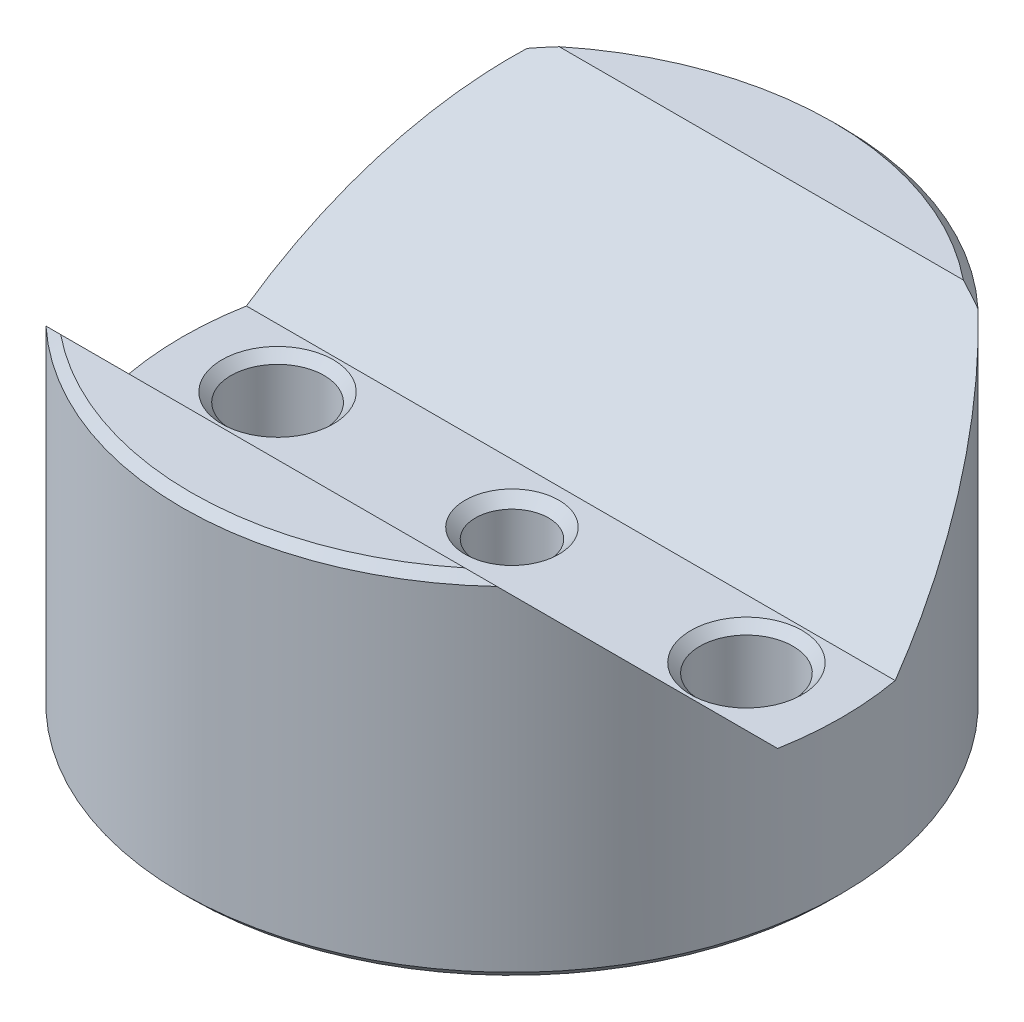
ISO-10303-21;
HEADER;
FILE_DESCRIPTION(('STEP AP214'),'2;1');
FILE_NAME('part.step','',(''),(''),'','','');
FILE_SCHEMA(('AUTOMOTIVE_DESIGN { 1 0 10303 214 1 1 1 1 }'));
ENDSEC;
DATA;
#1=APPLICATION_CONTEXT('core data for automotive mechanical design processes');
#2=APPLICATION_PROTOCOL_DEFINITION('international standard','automotive_design',2000,#1);
#3=PRODUCT_CONTEXT('',#1,'mechanical');
#4=PRODUCT('Part','Part','',(#3));
#5=PRODUCT_RELATED_PRODUCT_CATEGORY('part','',(#4));
#6=PRODUCT_DEFINITION_FORMATION('','',#4);
#7=PRODUCT_DEFINITION_CONTEXT('part definition',#1,'design');
#8=PRODUCT_DEFINITION('design','',#6,#7);
#9=PRODUCT_DEFINITION_SHAPE('','',#8);
#10=(LENGTH_UNIT() NAMED_UNIT(*) SI_UNIT(.MILLI.,.METRE.));
#11=(NAMED_UNIT(*) PLANE_ANGLE_UNIT() SI_UNIT($,.RADIAN.));
#12=(NAMED_UNIT(*) SI_UNIT($,.STERADIAN.) SOLID_ANGLE_UNIT());
#13=UNCERTAINTY_MEASURE_WITH_UNIT(LENGTH_MEASURE(1.E-05),#10,'distance_accuracy_value','');
#14=(GEOMETRIC_REPRESENTATION_CONTEXT(3) GLOBAL_UNCERTAINTY_ASSIGNED_CONTEXT((#13)) GLOBAL_UNIT_ASSIGNED_CONTEXT((#10,
#11,#12)) REPRESENTATION_CONTEXT('',''));
#15=CARTESIAN_POINT('',(0.,0.,0.));
#16=DIRECTION('',(0.,0.,1.));
#17=DIRECTION('',(1.,0.,0.));
#18=AXIS2_PLACEMENT_3D('',#15,#16,#17);
#19=CARTESIAN_POINT('',(0.,15.24,0.));
#20=DIRECTION('',(0.,1.,0.));
#21=DIRECTION('',(0.,0.,1.));
#22=AXIS2_PLACEMENT_3D('',#19,#20,#21);
#23=PLANE('',#22);
#24=DIRECTION('',(1.,0.,0.));
#25=VECTOR('',#24,1.);
#26=CARTESIAN_POINT('',(0.,15.24,10.8033841816037));
#27=LINE('',#26,#25);
#28=CARTESIAN_POINT('',(-8.75657652708381,15.24,10.8033841816037));
#29=VERTEX_POINT('',#28);
#30=CARTESIAN_POINT('',(8.75657652708381,15.24,10.8033841816037));
#31=VERTEX_POINT('',#30);
#32=EDGE_CURVE('E179',#29,#31,#27,.T.);
#33=ORIENTED_EDGE('',*,*,#32,.F.);
#34=CARTESIAN_POINT('',(0.,15.24,0.));
#35=DIRECTION('',(0.,1.,0.));
#36=DIRECTION('',(0.,0.,1.));
#37=AXIS2_PLACEMENT_3D('',#34,#35,#36);
#38=CIRCLE('',#37,13.9065);
#39=EDGE_CURVE('E251',#29,#31,#38,.T.);
#40=ORIENTED_EDGE('',*,*,#39,.T.);
#41=EDGE_LOOP('',(#33,#40));
#42=FACE_BOUND('',#41,.T.);
#43=ADVANCED_FACE('F92',(#42),#23,.T.);
#44=CARTESIAN_POINT('',(0.,15.24,0.));
#45=DIRECTION('',(0.,-1.,0.));
#46=DIRECTION('',(0.,0.,-1.));
#47=AXIS2_PLACEMENT_3D('',#44,#45,#46);
#48=CYLINDRICAL_SURFACE('',#47,14.2875);
#49=CARTESIAN_POINT('',(0.,0.381000000000012,0.));
#50=DIRECTION('',(0.,1.,0.));
#51=DIRECTION('',(0.,0.,1.));
#52=AXIS2_PLACEMENT_3D('',#49,#50,#51);
#53=CIRCLE('',#52,14.2875);
#54=CARTESIAN_POINT('',(0.,0.381000000000012,14.2875));
#55=VERTEX_POINT('',#54);
#56=EDGE_CURVE('E210',#55,#55,#53,.T.);
#57=ORIENTED_EDGE('',*,*,#56,.T.);
#58=EDGE_LOOP('',(#57));
#59=FACE_BOUND('',#58,.T.);
#60=CARTESIAN_POINT('',(0.,4.43661581839627,0.));
#61=DIRECTION('',(0.,-0.707106781186548,-0.707106781186547));
#62=DIRECTION('',(0.,-0.707106781186547,0.707106781186548));
#63=AXIS2_PLACEMENT_3D('',#60,#61,#62);
#64=ELLIPSE('',#63,20.2055762724056,14.2875);
#65=CARTESIAN_POINT('',(-14.0583923089716,6.985,-2.54838418160373));
#66=VERTEX_POINT('',#65);
#67=CARTESIAN_POINT('',(-9.77274599184158,14.859,-10.4223841816038));
#68=VERTEX_POINT('',#67);
#69=EDGE_CURVE('E150',#66,#68,#64,.T.);
#70=ORIENTED_EDGE('',*,*,#69,.T.);
#71=CARTESIAN_POINT('',(0.,14.859,0.));
#72=DIRECTION('',(0.,1.,0.));
#73=DIRECTION('',(0.,0.,1.));
#74=AXIS2_PLACEMENT_3D('',#71,#72,#73);
#75=CIRCLE('',#74,14.2875);
#76=CARTESIAN_POINT('',(9.77274599184158,14.859,-10.4223841816038));
#77=VERTEX_POINT('',#76);
#78=EDGE_CURVE('E208',#68,#77,#75,.F.);
#79=ORIENTED_EDGE('',*,*,#78,.T.);
#80=CARTESIAN_POINT('',(14.0583923089716,6.985,-2.54838418160373));
#81=VERTEX_POINT('',#80);
#82=EDGE_CURVE('E161',#77,#81,#64,.T.);
#83=ORIENTED_EDGE('',*,*,#82,.T.);
#84=CARTESIAN_POINT('',(0.,6.985,0.));
#85=DIRECTION('',(0.,-1.,0.));
#86=DIRECTION('',(0.,0.,-1.));
#87=AXIS2_PLACEMENT_3D('',#84,#85,#86);
#88=CIRCLE('',#87,14.2875);
#89=CARTESIAN_POINT('',(14.0583923089716,6.985,2.54838418160373));
#90=VERTEX_POINT('',#89);
#91=EDGE_CURVE('E171',#81,#90,#88,.T.);
#92=ORIENTED_EDGE('',*,*,#91,.T.);
#93=CARTESIAN_POINT('',(0.,4.43661581839627,0.));
#94=DIRECTION('',(0.,-0.707106781186548,0.707106781186547));
#95=DIRECTION('',(0.,-0.707106781186547,-0.707106781186548));
#96=AXIS2_PLACEMENT_3D('',#93,#94,#95);
#97=ELLIPSE('',#96,20.2055762724056,14.2875);
#98=CARTESIAN_POINT('',(9.77274599184159,14.859,10.4223841816038));
#99=VERTEX_POINT('',#98);
#100=EDGE_CURVE('E277',#90,#99,#97,.T.);
#101=ORIENTED_EDGE('',*,*,#100,.T.);
#102=CARTESIAN_POINT('',(0.,14.859,0.));
#103=DIRECTION('',(0.,1.,0.));
#104=DIRECTION('',(0.,0.,1.));
#105=AXIS2_PLACEMENT_3D('',#102,#103,#104);
#106=CIRCLE('',#105,14.2875);
#107=CARTESIAN_POINT('',(-9.77274599184159,14.859,10.4223841816038));
#108=VERTEX_POINT('',#107);
#109=EDGE_CURVE('E206',#99,#108,#106,.F.);
#110=ORIENTED_EDGE('',*,*,#109,.T.);
#111=CARTESIAN_POINT('',(-14.0583923089716,6.985,2.54838418160373));
#112=VERTEX_POINT('',#111);
#113=EDGE_CURVE('E160',#108,#112,#97,.T.);
#114=ORIENTED_EDGE('',*,*,#113,.T.);
#115=EDGE_CURVE('E168',#112,#66,#88,.T.);
#116=ORIENTED_EDGE('',*,*,#115,.T.);
#117=EDGE_LOOP('',(#70,#79,#83,#92,#101,#110,#114,#116));
#118=FACE_BOUND('',#117,.T.);
#119=ADVANCED_FACE('F94',(#59,#118),#48,.T.);
#120=DIRECTION('',(-1.,0.,0.));
#121=VECTOR('',#120,1.);
#122=CARTESIAN_POINT('',(0.,15.24,-10.8033841816037));
#123=LINE('',#122,#121);
#124=CARTESIAN_POINT('',(8.75657652708381,15.24,-10.8033841816037));
#125=VERTEX_POINT('',#124);
#126=CARTESIAN_POINT('',(-8.75657652708381,15.24,-10.8033841816037));
#127=VERTEX_POINT('',#126);
#128=EDGE_CURVE('E275',#125,#127,#123,.T.);
#129=ORIENTED_EDGE('',*,*,#128,.F.);
#130=CARTESIAN_POINT('',(0.,15.24,0.));
#131=DIRECTION('',(0.,1.,0.));
#132=DIRECTION('',(0.,0.,1.));
#133=AXIS2_PLACEMENT_3D('',#130,#131,#132);
#134=CIRCLE('',#133,13.9065);
#135=EDGE_CURVE('E216',#125,#127,#134,.T.);
#136=ORIENTED_EDGE('',*,*,#135,.T.);
#137=EDGE_LOOP('',(#129,#136));
#138=FACE_BOUND('',#137,.T.);
#139=ADVANCED_FACE('F263',(#138),#23,.T.);
#140=CARTESIAN_POINT('',(0.,0.,0.));
#141=DIRECTION('',(0.,1.,0.));
#142=DIRECTION('',(0.,0.,1.));
#143=AXIS2_PLACEMENT_3D('',#140,#141,#142);
#144=PLANE('',#143);
#145=CARTESIAN_POINT('',(0.,0.,0.));
#146=DIRECTION('',(0.,1.,0.));
#147=DIRECTION('',(0.,0.,1.));
#148=AXIS2_PLACEMENT_3D('',#145,#146,#147);
#149=CIRCLE('',#148,13.9065);
#150=CARTESIAN_POINT('',(0.,0.,13.9065));
#151=VERTEX_POINT('',#150);
#152=EDGE_CURVE('E213',#151,#151,#149,.F.);
#153=ORIENTED_EDGE('',*,*,#152,.T.);
#154=EDGE_LOOP('',(#153));
#155=FACE_BOUND('',#154,.T.);
#156=CARTESIAN_POINT('',(0.,0.,0.));
#157=DIRECTION('',(0.,-1.,0.));
#158=DIRECTION('',(0.,0.,-1.));
#159=AXIS2_PLACEMENT_3D('',#156,#157,#158);
#160=CIRCLE('',#159,6.35);
#161=CARTESIAN_POINT('',(0.,0.,-6.35));
#162=VERTEX_POINT('',#161);
#163=EDGE_CURVE('E282',#162,#162,#160,.T.);
#164=ORIENTED_EDGE('',*,*,#163,.F.);
#165=EDGE_LOOP('',(#164));
#166=FACE_BOUND('',#165,.T.);
#167=CARTESIAN_POINT('',(10.16,0.,0.));
#168=DIRECTION('',(0.,1.,0.));
#169=DIRECTION('',(0.,0.,1.));
#170=AXIS2_PLACEMENT_3D('',#167,#168,#169);
#171=CIRCLE('',#170,2.41299999999998);
#172=CARTESIAN_POINT('',(10.16,0.,2.41299999999998));
#173=VERTEX_POINT('',#172);
#174=EDGE_CURVE('E194',#173,#173,#171,.T.);
#175=ORIENTED_EDGE('',*,*,#174,.T.);
#176=EDGE_LOOP('',(#175));
#177=FACE_BOUND('',#176,.T.);
#178=CARTESIAN_POINT('',(-10.16,0.,0.));
#179=DIRECTION('',(0.,1.,0.));
#180=DIRECTION('',(0.,0.,1.));
#181=AXIS2_PLACEMENT_3D('',#178,#179,#180);
#182=CIRCLE('',#181,2.41299999999998);
#183=CARTESIAN_POINT('',(-10.16,0.,2.41299999999998));
#184=VERTEX_POINT('',#183);
#185=EDGE_CURVE('E191',#184,#184,#182,.T.);
#186=ORIENTED_EDGE('',*,*,#185,.T.);
#187=EDGE_LOOP('',(#186));
#188=FACE_BOUND('',#187,.T.);
#189=ADVANCED_FACE('F242',(#155,#166,#177,#188),#144,.F.);
#190=CARTESIAN_POINT('',(-14.2875,6.985,-2.54838418160373));
#191=DIRECTION('',(0.,-1.,0.));
#192=DIRECTION('',(0.,0.,-1.));
#193=AXIS2_PLACEMENT_3D('',#190,#191,#192);
#194=PLANE('',#193);
#195=CARTESIAN_POINT('',(0.,6.985,0.));
#196=DIRECTION('',(0.,-1.,0.));
#197=DIRECTION('',(0.,0.,-1.));
#198=AXIS2_PLACEMENT_3D('',#195,#196,#197);
#199=CIRCLE('',#198,2.032);
#200=CARTESIAN_POINT('',(0.,6.985,-2.032));
#201=VERTEX_POINT('',#200);
#202=EDGE_CURVE('E295',#201,#201,#199,.T.);
#203=ORIENTED_EDGE('',*,*,#202,.T.);
#204=EDGE_LOOP('',(#203));
#205=FACE_BOUND('',#204,.T.);
#206=CARTESIAN_POINT('',(10.16,6.985,0.));
#207=DIRECTION('',(0.,-1.,0.));
#208=DIRECTION('',(0.,0.,-1.));
#209=AXIS2_PLACEMENT_3D('',#206,#207,#208);
#210=CIRCLE('',#209,2.41299999999999);
#211=CARTESIAN_POINT('',(10.16,6.985,-2.41299999999999));
#212=VERTEX_POINT('',#211);
#213=EDGE_CURVE('E177',#212,#212,#210,.T.);
#214=ORIENTED_EDGE('',*,*,#213,.T.);
#215=EDGE_LOOP('',(#214));
#216=FACE_BOUND('',#215,.T.);
#217=CARTESIAN_POINT('',(-10.16,6.985,0.));
#218=DIRECTION('',(0.,-1.,0.));
#219=DIRECTION('',(0.,0.,-1.));
#220=AXIS2_PLACEMENT_3D('',#217,#218,#219);
#221=CIRCLE('',#220,2.41299999999999);
#222=CARTESIAN_POINT('',(-10.16,6.985,-2.41299999999999));
#223=VERTEX_POINT('',#222);
#224=EDGE_CURVE('E174',#223,#223,#221,.T.);
#225=ORIENTED_EDGE('',*,*,#224,.T.);
#226=EDGE_LOOP('',(#225));
#227=FACE_BOUND('',#226,.T.);
#228=DIRECTION('',(1.,0.,0.));
#229=VECTOR('',#228,1.);
#230=CARTESIAN_POINT('',(-14.2875,6.985,-2.54838418160373));
#231=LINE('',#230,#229);
#232=EDGE_CURVE('E155',#66,#81,#231,.T.);
#233=ORIENTED_EDGE('',*,*,#232,.F.);
#234=ORIENTED_EDGE('',*,*,#115,.F.);
#235=DIRECTION('',(1.,0.,0.));
#236=VECTOR('',#235,1.);
#237=CARTESIAN_POINT('',(-14.2875,6.985,2.54838418160373));
#238=LINE('',#237,#236);
#239=EDGE_CURVE('E172',#112,#90,#238,.T.);
#240=ORIENTED_EDGE('',*,*,#239,.T.);
#241=ORIENTED_EDGE('',*,*,#91,.F.);
#242=EDGE_LOOP('',(#233,#234,#240,#241));
#243=FACE_BOUND('',#242,.T.);
#244=ADVANCED_FACE('F166',(#205,#216,#227,#243),#194,.F.);
#245=CARTESIAN_POINT('',(-14.2875,6.985,2.54838418160373));
#246=DIRECTION('',(0.,-0.707106781186548,0.707106781186547));
#247=DIRECTION('',(0.,-0.707106781186547,-0.707106781186548));
#248=AXIS2_PLACEMENT_3D('',#245,#246,#247);
#249=PLANE('',#248);
#250=ORIENTED_EDGE('',*,*,#32,.T.);
#251=CARTESIAN_POINT('',(8.75657652708381,15.24,10.8033841816037));
#252=CARTESIAN_POINT('',(8.84227947885759,15.2096289773404,10.7730131589442));
#253=CARTESIAN_POINT('',(8.92772964032835,15.1789016635917,10.7422858451955));
#254=CARTESIAN_POINT('',(9.09811127153116,15.1167549928,10.6801391744038));
#255=CARTESIAN_POINT('',(9.18304280663491,15.0853357253763,10.64871990698));
#256=CARTESIAN_POINT('',(9.3523957525754,15.0218180037477,10.5852021853514));
#257=CARTESIAN_POINT('',(9.43681716577958,14.989719552698,10.5531037343017));
#258=CARTESIAN_POINT('',(9.6051598288421,14.9248553166724,10.4882394982762));
#259=CARTESIAN_POINT('',(9.68908101288975,14.8920894462902,10.4554736278939));
#260=CARTESIAN_POINT('',(9.77274599184159,14.859,10.4223841816038));
#261=B_SPLINE_CURVE_WITH_KNOTS('',3,(#251,#252,#253,#254,#255,#256,#257,#258,#259,#260),
.UNSPECIFIED.,.F.,.F.,(4,2,2,2,4),(0.,0.287588236579069,0.575139442343963,0.862689312573664,
1.15027621324247),.UNSPECIFIED.);
#262=EDGE_CURVE('E14',#31,#99,#261,.T.);
#263=ORIENTED_EDGE('',*,*,#262,.T.);
#264=ORIENTED_EDGE('',*,*,#100,.F.);
#265=ORIENTED_EDGE('',*,*,#239,.F.);
#266=ORIENTED_EDGE('',*,*,#113,.F.);
#267=CARTESIAN_POINT('',(-9.77274599184159,14.859,10.4223841816038));
#268=CARTESIAN_POINT('',(-9.68908101288975,14.8920894462902,10.4554736278939));
#269=CARTESIAN_POINT('',(-9.6051598288421,14.9248553166724,10.4882394982762));
#270=CARTESIAN_POINT('',(-9.43681716577958,14.989719552698,10.5531037343017));
#271=CARTESIAN_POINT('',(-9.3523957525754,15.0218180037477,10.5852021853514));
#272=CARTESIAN_POINT('',(-9.18304280663491,15.0853357253763,10.64871990698));
#273=CARTESIAN_POINT('',(-9.09811127153116,15.1167549928,10.6801391744038));
#274=CARTESIAN_POINT('',(-8.92772964032835,15.1789016635917,10.7422858451955));
#275=CARTESIAN_POINT('',(-8.84227947885759,15.2096289773404,10.7730131589442));
#276=CARTESIAN_POINT('',(-8.75657652708381,15.24,10.8033841816037));
#277=B_SPLINE_CURVE_WITH_KNOTS('',3,(#267,#268,#269,#270,#271,#272,#273,#274,#275,#276),
.UNSPECIFIED.,.F.,.F.,(4,2,2,2,4),(0.,0.287586900668805,0.575136770898506,0.8626879766634,
1.15027621324247),.UNSPECIFIED.);
#278=EDGE_CURVE('E105',#108,#29,#277,.T.);
#279=ORIENTED_EDGE('',*,*,#278,.T.);
#280=EDGE_LOOP('',(#250,#263,#264,#265,#266,#279));
#281=FACE_BOUND('',#280,.T.);
#282=ADVANCED_FACE('F238',(#281),#249,.F.);
#283=CARTESIAN_POINT('',(-14.2875,15.24,-10.8033841816037));
#284=DIRECTION('',(0.,-0.707106781186548,-0.707106781186547));
#285=DIRECTION('',(0.,0.707106781186547,-0.707106781186548));
#286=AXIS2_PLACEMENT_3D('',#283,#284,#285);
#287=PLANE('',#286);
#288=ORIENTED_EDGE('',*,*,#128,.T.);
#289=CARTESIAN_POINT('',(-8.75657652708381,15.24,-10.8033841816037));
#290=CARTESIAN_POINT('',(-8.84227947885759,15.2096289773404,-10.7730131589442));
#291=CARTESIAN_POINT('',(-8.92772964032835,15.1789016635917,-10.7422858451955));
#292=CARTESIAN_POINT('',(-9.09811127153116,15.1167549928001,-10.6801391744038));
#293=CARTESIAN_POINT('',(-9.1830428066349,15.0853357253763,-10.64871990698));
#294=CARTESIAN_POINT('',(-9.35239575257539,15.0218180037477,-10.5852021853514));
#295=CARTESIAN_POINT('',(-9.43681716577958,14.989719552698,-10.5531037343017));
#296=CARTESIAN_POINT('',(-9.6051598288421,14.9248553166724,-10.4882394982762));
#297=CARTESIAN_POINT('',(-9.68908101288975,14.8920894462902,-10.4554736278939));
#298=CARTESIAN_POINT('',(-9.77274599184158,14.859,-10.4223841816038));
#299=B_SPLINE_CURVE_WITH_KNOTS('',3,(#289,#290,#291,#292,#293,#294,#295,#296,#297,#298),
.UNSPECIFIED.,.F.,.F.,(4,2,2,2,4),(0.,0.287588236579067,0.575139442343959,0.862689312573661,
1.15027621324247),.UNSPECIFIED.);
#300=EDGE_CURVE('E156',#127,#68,#299,.T.);
#301=ORIENTED_EDGE('',*,*,#300,.T.);
#302=ORIENTED_EDGE('',*,*,#69,.F.);
#303=ORIENTED_EDGE('',*,*,#232,.T.);
#304=ORIENTED_EDGE('',*,*,#82,.F.);
#305=CARTESIAN_POINT('',(9.77274599184158,14.859,-10.4223841816038));
#306=CARTESIAN_POINT('',(9.68908101288975,14.8920894462902,-10.4554736278939));
#307=CARTESIAN_POINT('',(9.6051598288421,14.9248553166724,-10.4882394982762));
#308=CARTESIAN_POINT('',(9.43681716577958,14.989719552698,-10.5531037343017));
#309=CARTESIAN_POINT('',(9.35239575257539,15.0218180037477,-10.5852021853514));
#310=CARTESIAN_POINT('',(9.1830428066349,15.0853357253763,-10.64871990698));
#311=CARTESIAN_POINT('',(9.09811127153116,15.1167549928,-10.6801391744038));
#312=CARTESIAN_POINT('',(8.92772964032835,15.1789016635917,-10.7422858451955));
#313=CARTESIAN_POINT('',(8.84227947885759,15.2096289773404,-10.7730131589442));
#314=CARTESIAN_POINT('',(8.75657652708381,15.24,-10.8033841816037));
#315=B_SPLINE_CURVE_WITH_KNOTS('',3,(#305,#306,#307,#308,#309,#310,#311,#312,#313,#314),
.UNSPECIFIED.,.F.,.F.,(4,2,2,2,4),(0.,0.287586900668805,0.575136770898504,0.862687976663398,
1.15027621324247),.UNSPECIFIED.);
#316=EDGE_CURVE('E219',#77,#125,#315,.T.);
#317=ORIENTED_EDGE('',*,*,#316,.T.);
#318=EDGE_LOOP('',(#288,#301,#302,#303,#304,#317));
#319=FACE_BOUND('',#318,.T.);
#320=ADVANCED_FACE('F153',(#319),#287,.F.);
#321=CARTESIAN_POINT('',(10.16,0.,0.));
#322=DIRECTION('',(0.,-1.,0.));
#323=DIRECTION('',(0.,0.,-1.));
#324=AXIS2_PLACEMENT_3D('',#321,#322,#323);
#325=CYLINDRICAL_SURFACE('',#324,2.01929999999999);
#326=CARTESIAN_POINT('',(10.16,6.5913,0.));
#327=DIRECTION('',(0.,-1.,0.));
#328=DIRECTION('',(0.,0.,-1.));
#329=AXIS2_PLACEMENT_3D('',#326,#327,#328);
#330=CIRCLE('',#329,2.01929999999999);
#331=CARTESIAN_POINT('',(10.16,6.5913,-2.01929999999999));
#332=VERTEX_POINT('',#331);
#333=EDGE_CURVE('E188',#332,#332,#330,.F.);
#334=ORIENTED_EDGE('',*,*,#333,.T.);
#335=EDGE_LOOP('',(#334));
#336=FACE_BOUND('',#335,.T.);
#337=CARTESIAN_POINT('',(10.16,0.393699999999993,0.));
#338=DIRECTION('',(0.,1.,0.));
#339=DIRECTION('',(0.,0.,1.));
#340=AXIS2_PLACEMENT_3D('',#337,#338,#339);
#341=CIRCLE('',#340,2.01929999999999);
#342=CARTESIAN_POINT('',(10.16,0.393699999999993,2.01929999999999));
#343=VERTEX_POINT('',#342);
#344=EDGE_CURVE('E185',#343,#343,#341,.F.);
#345=ORIENTED_EDGE('',*,*,#344,.T.);
#346=EDGE_LOOP('',(#345));
#347=FACE_BOUND('',#346,.T.);
#348=ADVANCED_FACE('F237',(#336,#347),#325,.F.);
#349=CARTESIAN_POINT('',(-10.16,0.,0.));
#350=DIRECTION('',(0.,-1.,0.));
#351=DIRECTION('',(0.,0.,-1.));
#352=AXIS2_PLACEMENT_3D('',#349,#350,#351);
#353=CYLINDRICAL_SURFACE('',#352,2.01929999999999);
#354=CARTESIAN_POINT('',(-10.16,6.5913,0.));
#355=DIRECTION('',(0.,-1.,0.));
#356=DIRECTION('',(0.,0.,-1.));
#357=AXIS2_PLACEMENT_3D('',#354,#355,#356);
#358=CIRCLE('',#357,2.01929999999999);
#359=CARTESIAN_POINT('',(-10.16,6.5913,-2.01929999999999));
#360=VERTEX_POINT('',#359);
#361=EDGE_CURVE('E200',#360,#360,#358,.F.);
#362=ORIENTED_EDGE('',*,*,#361,.T.);
#363=EDGE_LOOP('',(#362));
#364=FACE_BOUND('',#363,.T.);
#365=CARTESIAN_POINT('',(-10.16,0.393699999999993,0.));
#366=DIRECTION('',(0.,1.,0.));
#367=DIRECTION('',(0.,0.,1.));
#368=AXIS2_PLACEMENT_3D('',#365,#366,#367);
#369=CIRCLE('',#368,2.01929999999999);
#370=CARTESIAN_POINT('',(-10.16,0.393699999999993,2.01929999999999));
#371=VERTEX_POINT('',#370);
#372=EDGE_CURVE('E197',#371,#371,#369,.F.);
#373=ORIENTED_EDGE('',*,*,#372,.T.);
#374=EDGE_LOOP('',(#373));
#375=FACE_BOUND('',#374,.T.);
#376=ADVANCED_FACE('F345',(#364,#375),#353,.F.);
#377=CARTESIAN_POINT('',(10.16,6.985,0.));
#378=DIRECTION('',(0.,1.,0.));
#379=DIRECTION('',(0.,0.,1.));
#380=AXIS2_PLACEMENT_3D('',#377,#378,#379);
#381=CONICAL_SURFACE('',#380,2.41299999999999,0.785398163397447);
#382=ORIENTED_EDGE('',*,*,#333,.F.);
#383=EDGE_LOOP('',(#382));
#384=FACE_BOUND('',#383,.T.);
#385=ORIENTED_EDGE('',*,*,#213,.F.);
#386=EDGE_LOOP('',(#385));
#387=FACE_BOUND('',#386,.T.);
#388=ADVANCED_FACE('F342',(#384,#387),#381,.F.);
#389=CARTESIAN_POINT('',(10.16,0.393699999999993,0.));
#390=DIRECTION('',(0.,-1.,0.));
#391=DIRECTION('',(0.,0.,-1.));
#392=AXIS2_PLACEMENT_3D('',#389,#390,#391);
#393=CONICAL_SURFACE('',#392,2.01929999999999,0.785398163397444);
#394=ORIENTED_EDGE('',*,*,#174,.F.);
#395=EDGE_LOOP('',(#394));
#396=FACE_BOUND('',#395,.T.);
#397=ORIENTED_EDGE('',*,*,#344,.F.);
#398=EDGE_LOOP('',(#397));
#399=FACE_BOUND('',#398,.T.);
#400=ADVANCED_FACE('F338',(#396,#399),#393,.F.);
#401=CARTESIAN_POINT('',(-10.16,6.985,0.));
#402=DIRECTION('',(0.,1.,0.));
#403=DIRECTION('',(0.,0.,1.));
#404=AXIS2_PLACEMENT_3D('',#401,#402,#403);
#405=CONICAL_SURFACE('',#404,2.41299999999999,0.785398163397447);
#406=ORIENTED_EDGE('',*,*,#361,.F.);
#407=EDGE_LOOP('',(#406));
#408=FACE_BOUND('',#407,.T.);
#409=ORIENTED_EDGE('',*,*,#224,.F.);
#410=EDGE_LOOP('',(#409));
#411=FACE_BOUND('',#410,.T.);
#412=ADVANCED_FACE('F334',(#408,#411),#405,.F.);
#413=CARTESIAN_POINT('',(-10.16,0.393699999999993,0.));
#414=DIRECTION('',(0.,-1.,0.));
#415=DIRECTION('',(0.,0.,-1.));
#416=AXIS2_PLACEMENT_3D('',#413,#414,#415);
#417=CONICAL_SURFACE('',#416,2.01929999999999,0.785398163397444);
#418=ORIENTED_EDGE('',*,*,#185,.F.);
#419=EDGE_LOOP('',(#418));
#420=FACE_BOUND('',#419,.T.);
#421=ORIENTED_EDGE('',*,*,#372,.F.);
#422=EDGE_LOOP('',(#421));
#423=FACE_BOUND('',#422,.T.);
#424=ADVANCED_FACE('F322',(#420,#423),#417,.F.);
#425=CARTESIAN_POINT('',(0.,0.635,0.));
#426=DIRECTION('',(0.,-1.,0.));
#427=DIRECTION('',(0.,0.,-1.));
#428=AXIS2_PLACEMENT_3D('',#425,#426,#427);
#429=PLANE('',#428);
#430=CARTESIAN_POINT('',(0.,0.635,0.));
#431=DIRECTION('',(0.,-1.,0.));
#432=DIRECTION('',(0.,0.,-1.));
#433=AXIS2_PLACEMENT_3D('',#430,#431,#432);
#434=CIRCLE('',#433,1.905);
#435=CARTESIAN_POINT('',(0.,0.635,-1.905));
#436=VERTEX_POINT('',#435);
#437=EDGE_CURVE('E286',#436,#436,#434,.T.);
#438=ORIENTED_EDGE('',*,*,#437,.F.);
#439=EDGE_LOOP('',(#438));
#440=FACE_BOUND('',#439,.T.);
#441=CARTESIAN_POINT('',(0.,0.635,0.));
#442=DIRECTION('',(0.,-1.,0.));
#443=DIRECTION('',(0.,0.,-1.));
#444=AXIS2_PLACEMENT_3D('',#441,#442,#443);
#445=CIRCLE('',#444,5.71500000000001);
#446=CARTESIAN_POINT('',(0.,0.635,-5.71500000000001));
#447=VERTEX_POINT('',#446);
#448=EDGE_CURVE('E203',#447,#447,#445,.T.);
#449=ORIENTED_EDGE('',*,*,#448,.T.);
#450=EDGE_LOOP('',(#449));
#451=FACE_BOUND('',#450,.T.);
#452=ADVANCED_FACE('F319',(#440,#451),#429,.T.);
#453=CARTESIAN_POINT('',(0.,0.635,0.));
#454=DIRECTION('',(0.,-1.,0.));
#455=DIRECTION('',(0.,0.,-1.));
#456=AXIS2_PLACEMENT_3D('',#453,#454,#455);
#457=CONICAL_SURFACE('',#456,5.71500000000001,0.78539816339745);
#458=ORIENTED_EDGE('',*,*,#163,.T.);
#459=EDGE_LOOP('',(#458));
#460=FACE_BOUND('',#459,.T.);
#461=ORIENTED_EDGE('',*,*,#448,.F.);
#462=EDGE_LOOP('',(#461));
#463=FACE_BOUND('',#462,.T.);
#464=ADVANCED_FACE('F315',(#460,#463),#457,.F.);
#465=CARTESIAN_POINT('',(0.,0.635,0.));
#466=DIRECTION('',(0.,-1.,0.));
#467=DIRECTION('',(0.,0.,-1.));
#468=AXIS2_PLACEMENT_3D('',#465,#466,#467);
#469=CONICAL_SURFACE('',#468,1.905,0.785398163397454);
#470=CARTESIAN_POINT('',(0.,0.952499999999996,0.));
#471=DIRECTION('',(0.,-1.,0.));
#472=DIRECTION('',(0.,0.,-1.));
#473=AXIS2_PLACEMENT_3D('',#470,#471,#472);
#474=CIRCLE('',#473,1.5875);
#475=CARTESIAN_POINT('',(0.,0.952499999999996,-1.5875));
#476=VERTEX_POINT('',#475);
#477=EDGE_CURVE('E289',#476,#476,#474,.T.);
#478=ORIENTED_EDGE('',*,*,#477,.F.);
#479=EDGE_LOOP('',(#478));
#480=FACE_BOUND('',#479,.T.);
#481=ORIENTED_EDGE('',*,*,#437,.T.);
#482=EDGE_LOOP('',(#481));
#483=FACE_BOUND('',#482,.T.);
#484=ADVANCED_FACE('F309',(#480,#483),#469,.F.);
#485=CARTESIAN_POINT('',(0.,0.,0.));
#486=DIRECTION('',(0.,-1.,0.));
#487=DIRECTION('',(0.,0.,-1.));
#488=AXIS2_PLACEMENT_3D('',#485,#486,#487);
#489=CYLINDRICAL_SURFACE('',#488,1.5875);
#490=CARTESIAN_POINT('',(0.,6.5405,0.));
#491=DIRECTION('',(0.,-1.,0.));
#492=DIRECTION('',(0.,0.,-1.));
#493=AXIS2_PLACEMENT_3D('',#490,#491,#492);
#494=CIRCLE('',#493,1.5875);
#495=CARTESIAN_POINT('',(0.,6.5405,-1.5875));
#496=VERTEX_POINT('',#495);
#497=EDGE_CURVE('E292',#496,#496,#494,.T.);
#498=ORIENTED_EDGE('',*,*,#497,.F.);
#499=EDGE_LOOP('',(#498));
#500=FACE_BOUND('',#499,.T.);
#501=ORIENTED_EDGE('',*,*,#477,.T.);
#502=EDGE_LOOP('',(#501));
#503=FACE_BOUND('',#502,.T.);
#504=ADVANCED_FACE('F303',(#500,#503),#489,.F.);
#505=CARTESIAN_POINT('',(0.,6.5405,0.));
#506=DIRECTION('',(0.,1.,0.));
#507=DIRECTION('',(0.,0.,1.));
#508=AXIS2_PLACEMENT_3D('',#505,#506,#507);
#509=CONICAL_SURFACE('',#508,1.5875,0.785398163397443);
#510=ORIENTED_EDGE('',*,*,#202,.F.);
#511=EDGE_LOOP('',(#510));
#512=FACE_BOUND('',#511,.T.);
#513=ORIENTED_EDGE('',*,*,#497,.T.);
#514=EDGE_LOOP('',(#513));
#515=FACE_BOUND('',#514,.T.);
#516=ADVANCED_FACE('F300',(#512,#515),#509,.F.);
#517=CARTESIAN_POINT('',(0.,0.381000000000012,0.));
#518=DIRECTION('',(0.,1.,0.));
#519=DIRECTION('',(0.,0.,1.));
#520=AXIS2_PLACEMENT_3D('',#517,#518,#519);
#521=CONICAL_SURFACE('',#520,14.2875,0.785398163397453);
#522=ORIENTED_EDGE('',*,*,#152,.F.);
#523=EDGE_LOOP('',(#522));
#524=FACE_BOUND('',#523,.T.);
#525=ORIENTED_EDGE('',*,*,#56,.F.);
#526=EDGE_LOOP('',(#525));
#527=FACE_BOUND('',#526,.T.);
#528=ADVANCED_FACE('F259',(#524,#527),#521,.T.);
#529=CARTESIAN_POINT('',(0.,15.24,0.));
#530=DIRECTION('',(0.,-1.,0.));
#531=DIRECTION('',(0.,0.,-1.));
#532=AXIS2_PLACEMENT_3D('',#529,#530,#531);
#533=CONICAL_SURFACE('',#532,13.9065,0.785398163397451);
#534=ORIENTED_EDGE('',*,*,#316,.F.);
#535=ORIENTED_EDGE('',*,*,#78,.F.);
#536=ORIENTED_EDGE('',*,*,#300,.F.);
#537=ORIENTED_EDGE('',*,*,#135,.F.);
#538=EDGE_LOOP('',(#534,#535,#536,#537));
#539=FACE_BOUND('',#538,.T.);
#540=ADVANCED_FACE('F230',(#539),#533,.T.);
#541=CARTESIAN_POINT('',(0.,15.24,0.));
#542=DIRECTION('',(0.,-1.,0.));
#543=DIRECTION('',(0.,0.,-1.));
#544=AXIS2_PLACEMENT_3D('',#541,#542,#543);
#545=CONICAL_SURFACE('',#544,13.9065,0.785398163397451);
#546=ORIENTED_EDGE('',*,*,#278,.F.);
#547=ORIENTED_EDGE('',*,*,#109,.F.);
#548=ORIENTED_EDGE('',*,*,#262,.F.);
#549=ORIENTED_EDGE('',*,*,#39,.F.);
#550=EDGE_LOOP('',(#546,#547,#548,#549));
#551=FACE_BOUND('',#550,.T.);
#552=ADVANCED_FACE('F252',(#551),#545,.T.);
#553=CLOSED_SHELL('',(#43,#119,#139,#189,#244,#282,#320,#348,#376,#388,#400,#412,#424,#452,#464,
#484,#504,#516,#528,#540,#552));
#554=MANIFOLD_SOLID_BREP('B2',#553);
#555=ADVANCED_BREP_SHAPE_REPRESENTATION('',(#18,#554),#14);
#556=SHAPE_DEFINITION_REPRESENTATION(#9,#555);
ENDSEC;
END-ISO-10303-21;
